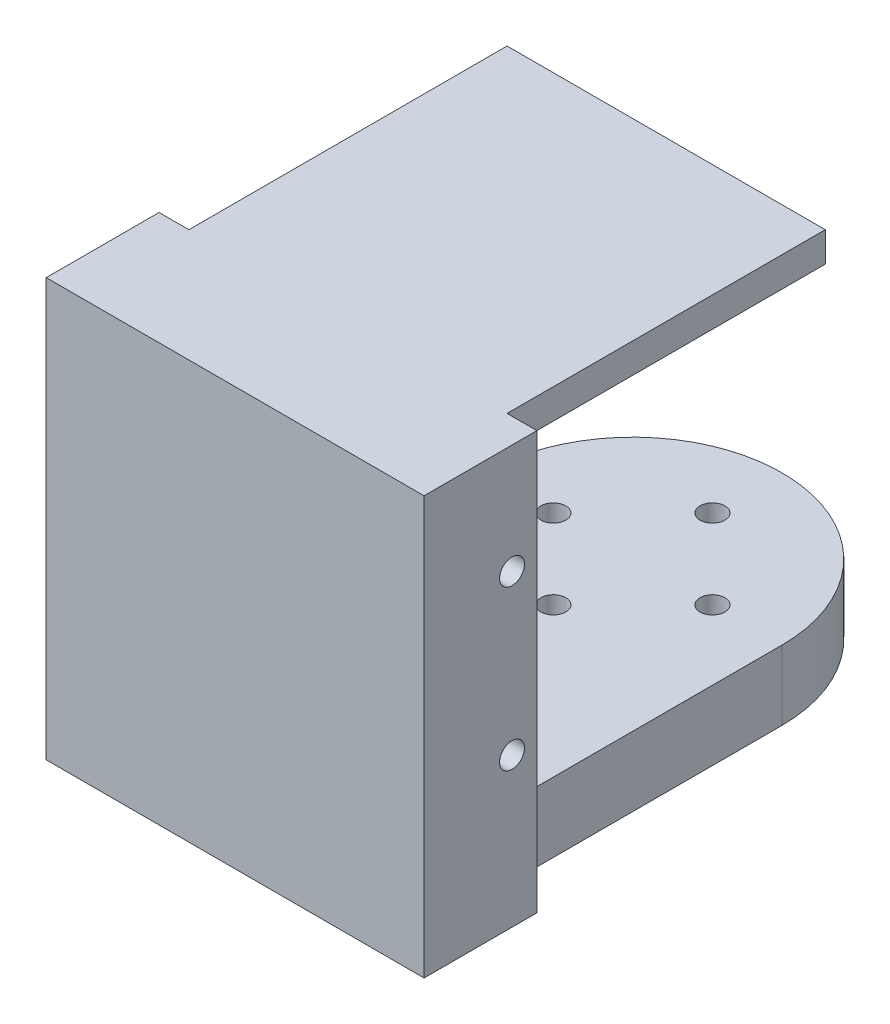
ISO-10303-21;
HEADER;
FILE_DESCRIPTION(('STEP AP214'),'2;1');
FILE_NAME('part.step','',(''),(''),'','','');
FILE_SCHEMA(('AUTOMOTIVE_DESIGN { 1 0 10303 214 1 1 1 1 }'));
ENDSEC;
DATA;
#1=APPLICATION_CONTEXT('core data for automotive mechanical design processes');
#2=APPLICATION_PROTOCOL_DEFINITION('international standard','automotive_design',2000,#1);
#3=PRODUCT_CONTEXT('',#1,'mechanical');
#4=PRODUCT('Part','Part','',(#3));
#5=PRODUCT_RELATED_PRODUCT_CATEGORY('part','',(#4));
#6=PRODUCT_DEFINITION_FORMATION('','',#4);
#7=PRODUCT_DEFINITION_CONTEXT('part definition',#1,'design');
#8=PRODUCT_DEFINITION('design','',#6,#7);
#9=PRODUCT_DEFINITION_SHAPE('','',#8);
#10=(LENGTH_UNIT() NAMED_UNIT(*) SI_UNIT(.MILLI.,.METRE.));
#11=(NAMED_UNIT(*) PLANE_ANGLE_UNIT() SI_UNIT($,.RADIAN.));
#12=(NAMED_UNIT(*) SI_UNIT($,.STERADIAN.) SOLID_ANGLE_UNIT());
#13=UNCERTAINTY_MEASURE_WITH_UNIT(LENGTH_MEASURE(1.E-05),#10,'distance_accuracy_value','');
#14=(GEOMETRIC_REPRESENTATION_CONTEXT(3) GLOBAL_UNCERTAINTY_ASSIGNED_CONTEXT((#13)) GLOBAL_UNIT_ASSIGNED_CONTEXT((#10,
#11,#12)) REPRESENTATION_CONTEXT('',''));
#15=CARTESIAN_POINT('',(0.,0.,0.));
#16=DIRECTION('',(0.,0.,1.));
#17=DIRECTION('',(1.,0.,0.));
#18=AXIS2_PLACEMENT_3D('',#15,#16,#17);
#19=CARTESIAN_POINT('',(11.,39.,-6.34691914212264));
#20=DIRECTION('',(1.,0.,0.));
#21=DIRECTION('',(0.,0.,-1.));
#22=AXIS2_PLACEMENT_3D('',#19,#20,#21);
#23=PLANE('',#22);
#24=DIRECTION('',(0.,1.,0.));
#25=VECTOR('',#24,1.);
#26=CARTESIAN_POINT('',(11.,7.,33.6530808578774));
#27=LINE('',#26,#25);
#28=CARTESIAN_POINT('',(11.,36.,33.6530808578774));
#29=VERTEX_POINT('',#28);
#30=CARTESIAN_POINT('',(11.,39.,33.6530808578774));
#31=VERTEX_POINT('',#30);
#32=EDGE_CURVE('E172',#29,#31,#27,.T.);
#33=ORIENTED_EDGE('',*,*,#32,.F.);
#34=DIRECTION('',(0.,0.,-1.));
#35=VECTOR('',#34,1.);
#36=CARTESIAN_POINT('',(11.,36.,13.6530808578774));
#37=LINE('',#36,#35);
#38=CARTESIAN_POINT('',(11.,36.,-3.34691914212264));
#39=VERTEX_POINT('',#38);
#40=EDGE_CURVE('E157',#39,#29,#37,.F.);
#41=ORIENTED_EDGE('',*,*,#40,.F.);
#42=DIRECTION('',(0.,1.,0.));
#43=VECTOR('',#42,1.);
#44=CARTESIAN_POINT('',(11.,40.5,-3.34691914212264));
#45=LINE('',#44,#43);
#46=CARTESIAN_POINT('',(11.,39.,-3.34691914212264));
#47=VERTEX_POINT('',#46);
#48=EDGE_CURVE('E192',#39,#47,#45,.T.);
#49=ORIENTED_EDGE('',*,*,#48,.T.);
#50=DIRECTION('',(0.,0.,1.));
#51=VECTOR('',#50,1.);
#52=CARTESIAN_POINT('',(11.,39.,33.6530808578774));
#53=LINE('',#52,#51);
#54=EDGE_CURVE('E181',#31,#47,#53,.F.);
#55=ORIENTED_EDGE('',*,*,#54,.F.);
#56=EDGE_LOOP('',(#33,#41,#49,#55));
#57=FACE_BOUND('',#56,.T.);
#58=ADVANCED_FACE('F17',(#57),#23,.T.);
#59=CARTESIAN_POINT('',(-11.,39.,33.6530808578774));
#60=DIRECTION('',(-1.,0.,0.));
#61=DIRECTION('',(0.,0.,1.));
#62=AXIS2_PLACEMENT_3D('',#59,#60,#61);
#63=PLANE('',#62);
#64=DIRECTION('',(0.,1.,0.));
#65=VECTOR('',#64,1.);
#66=CARTESIAN_POINT('',(-11.,7.,33.6530808578774));
#67=LINE('',#66,#65);
#68=CARTESIAN_POINT('',(-11.,39.,33.6530808578774));
#69=VERTEX_POINT('',#68);
#70=CARTESIAN_POINT('',(-11.,36.,33.6530808578774));
#71=VERTEX_POINT('',#70);
#72=EDGE_CURVE('E176',#69,#71,#67,.F.);
#73=ORIENTED_EDGE('',*,*,#72,.F.);
#74=DIRECTION('',(0.,0.,1.));
#75=VECTOR('',#74,1.);
#76=CARTESIAN_POINT('',(-11.,39.,33.6530808578774));
#77=LINE('',#76,#75);
#78=CARTESIAN_POINT('',(-11.,39.,-3.34691914212264));
#79=VERTEX_POINT('',#78);
#80=EDGE_CURVE('E215',#79,#69,#77,.T.);
#81=ORIENTED_EDGE('',*,*,#80,.F.);
#82=DIRECTION('',(0.,1.,0.));
#83=VECTOR('',#82,1.);
#84=CARTESIAN_POINT('',(-11.,40.5,-3.34691914212264));
#85=LINE('',#84,#83);
#86=CARTESIAN_POINT('',(-11.,36.,-3.34691914212264));
#87=VERTEX_POINT('',#86);
#88=EDGE_CURVE('E210',#79,#87,#85,.F.);
#89=ORIENTED_EDGE('',*,*,#88,.T.);
#90=DIRECTION('',(0.,0.,-1.));
#91=VECTOR('',#90,1.);
#92=CARTESIAN_POINT('',(-11.,36.,13.6530808578774));
#93=LINE('',#92,#91);
#94=EDGE_CURVE('E168',#71,#87,#93,.T.);
#95=ORIENTED_EDGE('',*,*,#94,.F.);
#96=EDGE_LOOP('',(#73,#81,#89,#95));
#97=FACE_BOUND('',#96,.T.);
#98=ADVANCED_FACE('F677',(#97),#63,.T.);
#99=CARTESIAN_POINT('',(0.,36.,13.6530808578774));
#100=DIRECTION('',(0.,-1.,0.));
#101=DIRECTION('',(0.,0.,-1.));
#102=AXIS2_PLACEMENT_3D('',#99,#100,#101);
#103=PLANE('',#102);
#104=DIRECTION('',(-1.,0.,0.));
#105=VECTOR('',#104,1.);
#106=CARTESIAN_POINT('',(15.,36.,33.6530808578774));
#107=LINE('',#106,#105);
#108=EDGE_CURVE('E160',#71,#29,#107,.F.);
#109=ORIENTED_EDGE('',*,*,#108,.F.);
#110=ORIENTED_EDGE('',*,*,#94,.T.);
#111=DIRECTION('',(1.,0.,0.));
#112=VECTOR('',#111,1.);
#113=CARTESIAN_POINT('',(0.,36.,-3.34691914212264));
#114=LINE('',#113,#112);
#115=EDGE_CURVE('E162',#87,#39,#114,.T.);
#116=ORIENTED_EDGE('',*,*,#115,.T.);
#117=ORIENTED_EDGE('',*,*,#40,.T.);
#118=EDGE_LOOP('',(#109,#110,#116,#117));
#119=FACE_BOUND('',#118,.T.);
#120=ADVANCED_FACE('F159',(#119),#103,.T.);
#121=CARTESIAN_POINT('',(16.,39.,33.6530808578774));
#122=DIRECTION('',(0.,-1.,0.));
#123=DIRECTION('',(1.,0.,0.));
#124=AXIS2_PLACEMENT_3D('',#121,#122,#123);
#125=PLANE('',#124);
#126=DIRECTION('',(0.,0.,-1.));
#127=VECTOR('',#126,1.);
#128=CARTESIAN_POINT('',(-16.,39.,33.6530808578774));
#129=LINE('',#128,#127);
#130=CARTESIAN_POINT('',(-16.,39.,28.6530808578774));
#131=VERTEX_POINT('',#130);
#132=CARTESIAN_POINT('',(-16.,39.,33.6530808578774));
#133=VERTEX_POINT('',#132);
#134=EDGE_CURVE('E302',#131,#133,#129,.F.);
#135=ORIENTED_EDGE('',*,*,#134,.F.);
#136=DIRECTION('',(0.,0.,1.));
#137=VECTOR('',#136,1.);
#138=CARTESIAN_POINT('',(-16.,39.,33.6530808578774));
#139=LINE('',#138,#137);
#140=CARTESIAN_POINT('',(-16.,39.,-3.34691914212264));
#141=VERTEX_POINT('',#140);
#142=EDGE_CURVE('E309',#141,#131,#139,.T.);
#143=ORIENTED_EDGE('',*,*,#142,.F.);
#144=DIRECTION('',(1.,0.,0.));
#145=VECTOR('',#144,1.);
#146=CARTESIAN_POINT('',(0.,39.,-3.34691914212264));
#147=LINE('',#146,#145);
#148=EDGE_CURVE('E221',#141,#79,#147,.T.);
#149=ORIENTED_EDGE('',*,*,#148,.T.);
#150=ORIENTED_EDGE('',*,*,#80,.T.);
#151=DIRECTION('',(-1.,0.,0.));
#152=VECTOR('',#151,1.);
#153=CARTESIAN_POINT('',(15.,39.,33.6530808578774));
#154=LINE('',#153,#152);
#155=EDGE_CURVE('E190',#133,#69,#154,.F.);
#156=ORIENTED_EDGE('',*,*,#155,.F.);
#157=EDGE_LOOP('',(#135,#143,#149,#150,#156));
#158=FACE_BOUND('',#157,.T.);
#159=ADVANCED_FACE('F474',(#158),#125,.T.);
#160=CARTESIAN_POINT('',(16.,39.,33.6530808578774));
#161=DIRECTION('',(0.,-1.,0.));
#162=DIRECTION('',(1.,0.,0.));
#163=AXIS2_PLACEMENT_3D('',#160,#161,#162);
#164=PLANE('',#163);
#165=DIRECTION('',(-1.,0.,0.));
#166=VECTOR('',#165,1.);
#167=CARTESIAN_POINT('',(15.,39.,33.6530808578774));
#168=LINE('',#167,#166);
#169=CARTESIAN_POINT('',(16.,39.,33.6530808578774));
#170=VERTEX_POINT('',#169);
#171=EDGE_CURVE('E184',#31,#170,#168,.F.);
#172=ORIENTED_EDGE('',*,*,#171,.F.);
#173=ORIENTED_EDGE('',*,*,#54,.T.);
#174=DIRECTION('',(1.,0.,0.));
#175=VECTOR('',#174,1.);
#176=CARTESIAN_POINT('',(0.,39.,-3.34691914212264));
#177=LINE('',#176,#175);
#178=CARTESIAN_POINT('',(16.,39.,-3.34691914212264));
#179=VERTEX_POINT('',#178);
#180=EDGE_CURVE('E185',#47,#179,#177,.T.);
#181=ORIENTED_EDGE('',*,*,#180,.T.);
#182=DIRECTION('',(0.,0.,-1.));
#183=VECTOR('',#182,1.);
#184=CARTESIAN_POINT('',(16.,39.,33.6530808578774));
#185=LINE('',#184,#183);
#186=CARTESIAN_POINT('',(16.,39.,28.6530808578774));
#187=VERTEX_POINT('',#186);
#188=EDGE_CURVE('E331',#187,#179,#185,.T.);
#189=ORIENTED_EDGE('',*,*,#188,.F.);
#190=DIRECTION('',(0.,0.,1.));
#191=VECTOR('',#190,1.);
#192=CARTESIAN_POINT('',(16.,39.,29.6530808578774));
#193=LINE('',#192,#191);
#194=EDGE_CURVE('E291',#170,#187,#193,.F.);
#195=ORIENTED_EDGE('',*,*,#194,.F.);
#196=EDGE_LOOP('',(#172,#173,#181,#189,#195));
#197=FACE_BOUND('',#196,.T.);
#198=ADVANCED_FACE('F368',(#197),#164,.T.);
#199=CARTESIAN_POINT('',(0.,40.5,-3.34691914212264));
#200=DIRECTION('',(0.,0.,1.));
#201=DIRECTION('',(1.,0.,0.));
#202=AXIS2_PLACEMENT_3D('',#199,#200,#201);
#203=PLANE('',#202);
#204=DIRECTION('',(0.,1.,0.));
#205=VECTOR('',#204,1.);
#206=CARTESIAN_POINT('',(16.,42.,-3.34691914212264));
#207=LINE('',#206,#205);
#208=CARTESIAN_POINT('',(16.,42.,-3.34691914212264));
#209=VERTEX_POINT('',#208);
#210=EDGE_CURVE('E283',#179,#209,#207,.T.);
#211=ORIENTED_EDGE('',*,*,#210,.F.);
#212=ORIENTED_EDGE('',*,*,#180,.F.);
#213=ORIENTED_EDGE('',*,*,#48,.F.);
#214=ORIENTED_EDGE('',*,*,#115,.F.);
#215=ORIENTED_EDGE('',*,*,#88,.F.);
#216=ORIENTED_EDGE('',*,*,#148,.F.);
#217=DIRECTION('',(0.,1.,0.));
#218=VECTOR('',#217,1.);
#219=CARTESIAN_POINT('',(-16.,39.,-3.34691914212264));
#220=LINE('',#219,#218);
#221=CARTESIAN_POINT('',(-16.,42.,-3.34691914212264));
#222=VERTEX_POINT('',#221);
#223=EDGE_CURVE('E179',#222,#141,#220,.F.);
#224=ORIENTED_EDGE('',*,*,#223,.F.);
#225=DIRECTION('',(1.,0.,0.));
#226=VECTOR('',#225,1.);
#227=CARTESIAN_POINT('',(0.,42.,-3.34691914212264));
#228=LINE('',#227,#226);
#229=EDGE_CURVE('E334',#209,#222,#228,.F.);
#230=ORIENTED_EDGE('',*,*,#229,.F.);
#231=EDGE_LOOP('',(#211,#212,#213,#214,#215,#216,#224,#230));
#232=FACE_BOUND('',#231,.T.);
#233=ADVANCED_FACE('F374',(#232),#203,.F.);
#234=CARTESIAN_POINT('',(15.,7.,33.6530808578774));
#235=DIRECTION('',(0.,0.,-1.));
#236=DIRECTION('',(-1.,0.,0.));
#237=AXIS2_PLACEMENT_3D('',#234,#235,#236);
#238=PLANE('',#237);
#239=ORIENTED_EDGE('',*,*,#72,.T.);
#240=ORIENTED_EDGE('',*,*,#108,.T.);
#241=ORIENTED_EDGE('',*,*,#32,.T.);
#242=ORIENTED_EDGE('',*,*,#171,.T.);
#243=DIRECTION('',(0.,1.,0.));
#244=VECTOR('',#243,1.);
#245=CARTESIAN_POINT('',(16.,7.,33.6530808578774));
#246=LINE('',#245,#244);
#247=CARTESIAN_POINT('',(16.,7.,33.6530808578774));
#248=VERTEX_POINT('',#247);
#249=EDGE_CURVE('E287',#248,#170,#246,.T.);
#250=ORIENTED_EDGE('',*,*,#249,.F.);
#251=DIRECTION('',(1.,0.,0.));
#252=VECTOR('',#251,1.);
#253=CARTESIAN_POINT('',(0.,7.,33.6530808578774));
#254=LINE('',#253,#252);
#255=CARTESIAN_POINT('',(-16.,7.,33.6530808578774));
#256=VERTEX_POINT('',#255);
#257=EDGE_CURVE('E317',#256,#248,#254,.T.);
#258=ORIENTED_EDGE('',*,*,#257,.F.);
#259=DIRECTION('',(0.,1.,0.));
#260=VECTOR('',#259,1.);
#261=CARTESIAN_POINT('',(-16.,7.,33.6530808578774));
#262=LINE('',#261,#260);
#263=EDGE_CURVE('E298',#133,#256,#262,.F.);
#264=ORIENTED_EDGE('',*,*,#263,.F.);
#265=ORIENTED_EDGE('',*,*,#155,.T.);
#266=EDGE_LOOP('',(#239,#240,#241,#242,#250,#258,#264,#265));
#267=FACE_BOUND('',#266,.T.);
#268=ADVANCED_FACE('F171',(#267),#238,.T.);
#269=CARTESIAN_POINT('',(-16.,39.,33.6530808578774));
#270=DIRECTION('',(-1.,0.,0.));
#271=DIRECTION('',(0.,0.,1.));
#272=AXIS2_PLACEMENT_3D('',#269,#270,#271);
#273=PLANE('',#272);
#274=DIRECTION('',(0.,1.,0.));
#275=VECTOR('',#274,1.);
#276=CARTESIAN_POINT('',(-16.,3.5,28.6530808578774));
#277=LINE('',#276,#275);
#278=CARTESIAN_POINT('',(-16.,42.,28.6530808578774));
#279=VERTEX_POINT('',#278);
#280=EDGE_CURVE('E434',#279,#131,#277,.F.);
#281=ORIENTED_EDGE('',*,*,#280,.F.);
#282=DIRECTION('',(0.,0.,1.));
#283=VECTOR('',#282,1.);
#284=CARTESIAN_POINT('',(-16.,42.,36.8265404289387));
#285=LINE('',#284,#283);
#286=EDGE_CURVE('E337',#222,#279,#285,.T.);
#287=ORIENTED_EDGE('',*,*,#286,.F.);
#288=ORIENTED_EDGE('',*,*,#223,.T.);
#289=ORIENTED_EDGE('',*,*,#142,.T.);
#290=EDGE_LOOP('',(#281,#287,#288,#289));
#291=FACE_BOUND('',#290,.T.);
#292=ADVANCED_FACE('F464',(#291),#273,.T.);
#293=CARTESIAN_POINT('',(-16.,7.,33.6530808578774));
#294=DIRECTION('',(1.,0.,0.));
#295=DIRECTION('',(0.,0.,-1.));
#296=AXIS2_PLACEMENT_3D('',#293,#294,#295);
#297=PLANE('',#296);
#298=CARTESIAN_POINT('',(-16.,31.0000001043081,31.1530808578774));
#299=DIRECTION('',(-1.,0.,0.));
#300=DIRECTION('',(0.,0.,1.));
#301=AXIS2_PLACEMENT_3D('',#298,#299,#300);
#302=CIRCLE('',#301,1.25);
#303=CARTESIAN_POINT('',(-16.,31.0000001043081,32.4030808578774));
#304=VERTEX_POINT('',#303);
#305=EDGE_CURVE('E20',#304,#304,#302,.T.);
#306=ORIENTED_EDGE('',*,*,#305,.T.);
#307=EDGE_LOOP('',(#306));
#308=FACE_BOUND('',#307,.T.);
#309=CARTESIAN_POINT('',(-16.,15.0000001043081,31.1530808578774));
#310=DIRECTION('',(-1.,0.,0.));
#311=DIRECTION('',(0.,0.,1.));
#312=AXIS2_PLACEMENT_3D('',#309,#310,#311);
#313=CIRCLE('',#312,1.25);
#314=CARTESIAN_POINT('',(-16.,15.0000001043081,32.4030808578774));
#315=VERTEX_POINT('',#314);
#316=EDGE_CURVE('E288',#315,#315,#313,.T.);
#317=ORIENTED_EDGE('',*,*,#316,.T.);
#318=EDGE_LOOP('',(#317));
#319=FACE_BOUND('',#318,.T.);
#320=DIRECTION('',(0.,0.,1.));
#321=VECTOR('',#320,1.);
#322=CARTESIAN_POINT('',(-16.,7.,12.5));
#323=LINE('',#322,#321);
#324=CARTESIAN_POINT('',(-16.,7.,28.6530808578774));
#325=VERTEX_POINT('',#324);
#326=EDGE_CURVE('E321',#325,#256,#323,.T.);
#327=ORIENTED_EDGE('',*,*,#326,.F.);
#328=DIRECTION('',(0.,1.,0.));
#329=VECTOR('',#328,1.);
#330=CARTESIAN_POINT('',(-16.,3.5,28.6530808578774));
#331=LINE('',#330,#329);
#332=EDGE_CURVE('E440',#131,#325,#331,.F.);
#333=ORIENTED_EDGE('',*,*,#332,.F.);
#334=ORIENTED_EDGE('',*,*,#134,.T.);
#335=ORIENTED_EDGE('',*,*,#263,.T.);
#336=EDGE_LOOP('',(#327,#333,#334,#335));
#337=FACE_BOUND('',#336,.T.);
#338=ADVANCED_FACE('F475',(#308,#319,#337),#297,.T.);
#339=CARTESIAN_POINT('',(16.,31.0000001043081,31.1530808578774));
#340=DIRECTION('',(-1.,0.,0.));
#341=DIRECTION('',(0.,0.,1.));
#342=AXIS2_PLACEMENT_3D('',#339,#340,#341);
#343=CYLINDRICAL_SURFACE('',#342,1.25);
#344=CARTESIAN_POINT('',(-19.,31.0000001043081,31.1530808578774));
#345=DIRECTION('',(-1.,0.,0.));
#346=DIRECTION('',(0.,0.,1.));
#347=AXIS2_PLACEMENT_3D('',#344,#345,#346);
#348=CIRCLE('',#347,1.25);
#349=CARTESIAN_POINT('',(-19.,31.0000001043081,32.4030808578774));
#350=VERTEX_POINT('',#349);
#351=EDGE_CURVE('E274',#350,#350,#348,.F.);
#352=ORIENTED_EDGE('',*,*,#351,.F.);
#353=EDGE_LOOP('',(#352));
#354=FACE_BOUND('',#353,.T.);
#355=ORIENTED_EDGE('',*,*,#305,.F.);
#356=EDGE_LOOP('',(#355));
#357=FACE_BOUND('',#356,.T.);
#358=ADVANCED_FACE('F655',(#354,#357),#343,.F.);
#359=CARTESIAN_POINT('',(16.,15.0000001043081,31.1530808578774));
#360=DIRECTION('',(-1.,0.,0.));
#361=DIRECTION('',(0.,0.,1.));
#362=AXIS2_PLACEMENT_3D('',#359,#360,#361);
#363=CYLINDRICAL_SURFACE('',#362,1.25);
#364=CARTESIAN_POINT('',(-19.,15.0000001043081,31.1530808578774));
#365=DIRECTION('',(-1.,0.,0.));
#366=DIRECTION('',(0.,0.,1.));
#367=AXIS2_PLACEMENT_3D('',#364,#365,#366);
#368=CIRCLE('',#367,1.25);
#369=CARTESIAN_POINT('',(-19.,15.0000001043081,32.4030808578774));
#370=VERTEX_POINT('',#369);
#371=EDGE_CURVE('E269',#370,#370,#368,.F.);
#372=ORIENTED_EDGE('',*,*,#371,.F.);
#373=EDGE_LOOP('',(#372));
#374=FACE_BOUND('',#373,.T.);
#375=ORIENTED_EDGE('',*,*,#316,.F.);
#376=EDGE_LOOP('',(#375));
#377=FACE_BOUND('',#376,.T.);
#378=ADVANCED_FACE('F645',(#374,#377),#363,.F.);
#379=CARTESIAN_POINT('',(16.,31.0000001043081,31.1530808578774));
#380=DIRECTION('',(1.,0.,0.));
#381=DIRECTION('',(0.,0.,-1.));
#382=AXIS2_PLACEMENT_3D('',#379,#380,#381);
#383=CYLINDRICAL_SURFACE('',#382,1.25);
#384=CARTESIAN_POINT('',(16.,31.0000001043081,31.1530808578774));
#385=DIRECTION('',(1.,0.,0.));
#386=DIRECTION('',(0.,0.,-1.));
#387=AXIS2_PLACEMENT_3D('',#384,#385,#386);
#388=CIRCLE('',#387,1.25);
#389=CARTESIAN_POINT('',(16.,31.0000001043081,29.9030808578774));
#390=VERTEX_POINT('',#389);
#391=EDGE_CURVE('E284',#390,#390,#388,.T.);
#392=ORIENTED_EDGE('',*,*,#391,.F.);
#393=EDGE_LOOP('',(#392));
#394=FACE_BOUND('',#393,.T.);
#395=CARTESIAN_POINT('',(19.,31.0000001043081,31.1530808578774));
#396=DIRECTION('',(1.,0.,0.));
#397=DIRECTION('',(0.,0.,-1.));
#398=AXIS2_PLACEMENT_3D('',#395,#396,#397);
#399=CIRCLE('',#398,1.25);
#400=CARTESIAN_POINT('',(19.,31.0000001043081,29.9030808578774));
#401=VERTEX_POINT('',#400);
#402=EDGE_CURVE('E264',#401,#401,#399,.F.);
#403=ORIENTED_EDGE('',*,*,#402,.F.);
#404=EDGE_LOOP('',(#403));
#405=FACE_BOUND('',#404,.T.);
#406=ADVANCED_FACE('F642',(#394,#405),#383,.F.);
#407=CARTESIAN_POINT('',(16.,15.0000001043081,31.1530808578774));
#408=DIRECTION('',(1.,0.,0.));
#409=DIRECTION('',(0.,0.,-1.));
#410=AXIS2_PLACEMENT_3D('',#407,#408,#409);
#411=CYLINDRICAL_SURFACE('',#410,1.25);
#412=CARTESIAN_POINT('',(16.,15.0000001043081,31.1530808578774));
#413=DIRECTION('',(1.,0.,0.));
#414=DIRECTION('',(0.,0.,-1.));
#415=AXIS2_PLACEMENT_3D('',#412,#413,#414);
#416=CIRCLE('',#415,1.25);
#417=CARTESIAN_POINT('',(16.,15.0000001043081,29.9030808578774));
#418=VERTEX_POINT('',#417);
#419=EDGE_CURVE('E279',#418,#418,#416,.T.);
#420=ORIENTED_EDGE('',*,*,#419,.F.);
#421=EDGE_LOOP('',(#420));
#422=FACE_BOUND('',#421,.T.);
#423=CARTESIAN_POINT('',(19.,15.0000001043081,31.1530808578774));
#424=DIRECTION('',(1.,0.,0.));
#425=DIRECTION('',(0.,0.,-1.));
#426=AXIS2_PLACEMENT_3D('',#423,#424,#425);
#427=CIRCLE('',#426,1.25);
#428=CARTESIAN_POINT('',(19.,15.0000001043081,29.9030808578774));
#429=VERTEX_POINT('',#428);
#430=EDGE_CURVE('E260',#429,#429,#427,.F.);
#431=ORIENTED_EDGE('',*,*,#430,.F.);
#432=EDGE_LOOP('',(#431));
#433=FACE_BOUND('',#432,.T.);
#434=ADVANCED_FACE('F644',(#422,#433),#411,.F.);
#435=CARTESIAN_POINT('',(16.,7.,29.6530808578774));
#436=DIRECTION('',(-1.,0.,0.));
#437=DIRECTION('',(0.,0.,1.));
#438=AXIS2_PLACEMENT_3D('',#435,#436,#437);
#439=PLANE('',#438);
#440=ORIENTED_EDGE('',*,*,#419,.T.);
#441=EDGE_LOOP('',(#440));
#442=FACE_BOUND('',#441,.T.);
#443=ORIENTED_EDGE('',*,*,#391,.T.);
#444=EDGE_LOOP('',(#443));
#445=FACE_BOUND('',#444,.T.);
#446=DIRECTION('',(0.,0.,1.));
#447=VECTOR('',#446,1.);
#448=CARTESIAN_POINT('',(16.,7.,12.5));
#449=LINE('',#448,#447);
#450=CARTESIAN_POINT('',(16.,7.,28.6530808578774));
#451=VERTEX_POINT('',#450);
#452=EDGE_CURVE('E389',#248,#451,#449,.F.);
#453=ORIENTED_EDGE('',*,*,#452,.F.);
#454=ORIENTED_EDGE('',*,*,#249,.T.);
#455=ORIENTED_EDGE('',*,*,#194,.T.);
#456=DIRECTION('',(0.,1.,0.));
#457=VECTOR('',#456,1.);
#458=CARTESIAN_POINT('',(16.,3.5,28.6530808578774));
#459=LINE('',#458,#457);
#460=EDGE_CURVE('E403',#451,#187,#459,.T.);
#461=ORIENTED_EDGE('',*,*,#460,.F.);
#462=EDGE_LOOP('',(#453,#454,#455,#461));
#463=FACE_BOUND('',#462,.T.);
#464=ADVANCED_FACE('F652',(#442,#445,#463),#439,.T.);
#465=CARTESIAN_POINT('',(16.,42.,33.6530808578774));
#466=DIRECTION('',(1.,0.,0.));
#467=DIRECTION('',(0.,0.,-1.));
#468=AXIS2_PLACEMENT_3D('',#465,#466,#467);
#469=PLANE('',#468);
#470=DIRECTION('',(0.,1.,0.));
#471=VECTOR('',#470,1.);
#472=CARTESIAN_POINT('',(16.,3.5,28.6530808578774));
#473=LINE('',#472,#471);
#474=CARTESIAN_POINT('',(16.,42.,28.6530808578774));
#475=VERTEX_POINT('',#474);
#476=EDGE_CURVE('E400',#187,#475,#473,.T.);
#477=ORIENTED_EDGE('',*,*,#476,.F.);
#478=ORIENTED_EDGE('',*,*,#188,.T.);
#479=ORIENTED_EDGE('',*,*,#210,.T.);
#480=DIRECTION('',(0.,0.,1.));
#481=VECTOR('',#480,1.);
#482=CARTESIAN_POINT('',(16.,42.,36.8265404289387));
#483=LINE('',#482,#481);
#484=EDGE_CURVE('E382',#475,#209,#483,.F.);
#485=ORIENTED_EDGE('',*,*,#484,.F.);
#486=EDGE_LOOP('',(#477,#478,#479,#485));
#487=FACE_BOUND('',#486,.T.);
#488=ADVANCED_FACE('F381',(#487),#469,.T.);
#489=CARTESIAN_POINT('',(0.,42.,36.8265404289387));
#490=DIRECTION('',(0.,1.,0.));
#491=DIRECTION('',(0.,0.,1.));
#492=AXIS2_PLACEMENT_3D('',#489,#490,#491);
#493=PLANE('',#492);
#494=DIRECTION('',(-1.,0.,0.));
#495=VECTOR('',#494,1.);
#496=CARTESIAN_POINT('',(17.,42.,28.6530808578774));
#497=LINE('',#496,#495);
#498=CARTESIAN_POINT('',(19.,42.,28.6530808578774));
#499=VERTEX_POINT('',#498);
#500=EDGE_CURVE('E387',#475,#499,#497,.F.);
#501=ORIENTED_EDGE('',*,*,#500,.F.);
#502=ORIENTED_EDGE('',*,*,#484,.T.);
#503=ORIENTED_EDGE('',*,*,#229,.T.);
#504=ORIENTED_EDGE('',*,*,#286,.T.);
#505=DIRECTION('',(-1.,0.,0.));
#506=VECTOR('',#505,1.);
#507=CARTESIAN_POINT('',(-17.,42.,28.6530808578774));
#508=LINE('',#507,#506);
#509=CARTESIAN_POINT('',(-19.,42.,28.6530808578774));
#510=VERTEX_POINT('',#509);
#511=EDGE_CURVE('E430',#510,#279,#508,.F.);
#512=ORIENTED_EDGE('',*,*,#511,.F.);
#513=DIRECTION('',(0.,0.,1.));
#514=VECTOR('',#513,1.);
#515=CARTESIAN_POINT('',(-19.,42.,36.8265404289387));
#516=LINE('',#515,#514);
#517=CARTESIAN_POINT('',(-19.,42.,40.));
#518=VERTEX_POINT('',#517);
#519=EDGE_CURVE('E424',#518,#510,#516,.F.);
#520=ORIENTED_EDGE('',*,*,#519,.F.);
#521=DIRECTION('',(1.,0.,0.));
#522=VECTOR('',#521,1.);
#523=CARTESIAN_POINT('',(-15.,42.,40.));
#524=LINE('',#523,#522);
#525=CARTESIAN_POINT('',(19.,42.,40.));
#526=VERTEX_POINT('',#525);
#527=EDGE_CURVE('E273',#526,#518,#524,.F.);
#528=ORIENTED_EDGE('',*,*,#527,.F.);
#529=DIRECTION('',(0.,0.,-1.));
#530=VECTOR('',#529,1.);
#531=CARTESIAN_POINT('',(19.,42.,36.8265404289387));
#532=LINE('',#531,#530);
#533=EDGE_CURVE('E535',#499,#526,#532,.F.);
#534=ORIENTED_EDGE('',*,*,#533,.F.);
#535=EDGE_LOOP('',(#501,#502,#503,#504,#512,#520,#528,#534));
#536=FACE_BOUND('',#535,.T.);
#537=ADVANCED_FACE('F385',(#536),#493,.T.);
#538=CARTESIAN_POINT('',(0.,7.,12.5));
#539=DIRECTION('',(0.,1.,0.));
#540=DIRECTION('',(0.,0.,1.));
#541=AXIS2_PLACEMENT_3D('',#538,#539,#540);
#542=PLANE('',#541);
#543=CARTESIAN_POINT('',(8.,7.,0.));
#544=DIRECTION('',(0.,1.,0.));
#545=DIRECTION('',(0.,0.,1.));
#546=AXIS2_PLACEMENT_3D('',#543,#544,#545);
#547=CIRCLE('',#546,1.25);
#548=CARTESIAN_POINT('',(8.,7.,1.25));
#549=VERTEX_POINT('',#548);
#550=EDGE_CURVE('E252',#549,#549,#547,.F.);
#551=ORIENTED_EDGE('',*,*,#550,.T.);
#552=EDGE_LOOP('',(#551));
#553=FACE_BOUND('',#552,.T.);
#554=CARTESIAN_POINT('',(-8.,7.,0.));
#555=DIRECTION('',(0.,1.,0.));
#556=DIRECTION('',(0.,0.,1.));
#557=AXIS2_PLACEMENT_3D('',#554,#555,#556);
#558=CIRCLE('',#557,1.25);
#559=CARTESIAN_POINT('',(-8.,7.,1.25));
#560=VERTEX_POINT('',#559);
#561=EDGE_CURVE('E248',#560,#560,#558,.F.);
#562=ORIENTED_EDGE('',*,*,#561,.T.);
#563=EDGE_LOOP('',(#562));
#564=FACE_BOUND('',#563,.T.);
#565=CARTESIAN_POINT('',(0.,7.,-8.));
#566=DIRECTION('',(0.,1.,0.));
#567=DIRECTION('',(0.,0.,1.));
#568=AXIS2_PLACEMENT_3D('',#565,#566,#567);
#569=CIRCLE('',#568,1.25);
#570=CARTESIAN_POINT('',(0.,7.,-6.75));
#571=VERTEX_POINT('',#570);
#572=EDGE_CURVE('E244',#571,#571,#569,.F.);
#573=ORIENTED_EDGE('',*,*,#572,.T.);
#574=EDGE_LOOP('',(#573));
#575=FACE_BOUND('',#574,.T.);
#576=CARTESIAN_POINT('',(0.,7.,8.));
#577=DIRECTION('',(0.,1.,0.));
#578=DIRECTION('',(0.,0.,1.));
#579=AXIS2_PLACEMENT_3D('',#576,#577,#578);
#580=CIRCLE('',#579,1.25);
#581=CARTESIAN_POINT('',(0.,7.,9.25));
#582=VERTEX_POINT('',#581);
#583=EDGE_CURVE('E239',#582,#582,#580,.F.);
#584=ORIENTED_EDGE('',*,*,#583,.T.);
#585=EDGE_LOOP('',(#584));
#586=FACE_BOUND('',#585,.T.);
#587=ORIENTED_EDGE('',*,*,#326,.T.);
#588=ORIENTED_EDGE('',*,*,#257,.T.);
#589=ORIENTED_EDGE('',*,*,#452,.T.);
#590=DIRECTION('',(-1.,0.,0.));
#591=VECTOR('',#590,1.);
#592=CARTESIAN_POINT('',(17.,7.,28.6530808578774));
#593=LINE('',#592,#591);
#594=CARTESIAN_POINT('',(15.,7.,28.6530808578774));
#595=VERTEX_POINT('',#594);
#596=EDGE_CURVE('E64',#595,#451,#593,.F.);
#597=ORIENTED_EDGE('',*,*,#596,.F.);
#598=DIRECTION('',(0.,0.,-1.));
#599=VECTOR('',#598,1.);
#600=CARTESIAN_POINT('',(15.,7.,40.));
#601=LINE('',#600,#599);
#602=CARTESIAN_POINT('',(15.,7.,0.));
#603=VERTEX_POINT('',#602);
#604=EDGE_CURVE('E508',#603,#595,#601,.F.);
#605=ORIENTED_EDGE('',*,*,#604,.F.);
#606=CARTESIAN_POINT('',(0.,7.,0.));
#607=DIRECTION('',(0.,1.,0.));
#608=DIRECTION('',(0.,0.,1.));
#609=AXIS2_PLACEMENT_3D('',#606,#607,#608);
#610=CIRCLE('',#609,15.);
#611=CARTESIAN_POINT('',(-15.,7.,0.));
#612=VERTEX_POINT('',#611);
#613=EDGE_CURVE('E256',#612,#603,#610,.F.);
#614=ORIENTED_EDGE('',*,*,#613,.F.);
#615=DIRECTION('',(0.,0.,1.));
#616=VECTOR('',#615,1.);
#617=CARTESIAN_POINT('',(-15.,7.,0.));
#618=LINE('',#617,#616);
#619=CARTESIAN_POINT('',(-15.,7.,28.6530808578774));
#620=VERTEX_POINT('',#619);
#621=EDGE_CURVE('E55',#620,#612,#618,.F.);
#622=ORIENTED_EDGE('',*,*,#621,.F.);
#623=DIRECTION('',(-1.,0.,0.));
#624=VECTOR('',#623,1.);
#625=CARTESIAN_POINT('',(-17.,7.,28.6530808578774));
#626=LINE('',#625,#624);
#627=EDGE_CURVE('E437',#325,#620,#626,.F.);
#628=ORIENTED_EDGE('',*,*,#627,.F.);
#629=EDGE_LOOP('',(#587,#588,#589,#597,#605,#614,#622,#628));
#630=FACE_BOUND('',#629,.T.);
#631=ADVANCED_FACE('F478',(#553,#564,#575,#586,#630),#542,.T.);
#632=CARTESIAN_POINT('',(-15.,0.,0.));
#633=DIRECTION('',(-1.,0.,0.));
#634=DIRECTION('',(0.,0.,1.));
#635=AXIS2_PLACEMENT_3D('',#632,#633,#634);
#636=PLANE('',#635);
#637=DIRECTION('',(0.,1.,0.));
#638=VECTOR('',#637,1.);
#639=CARTESIAN_POINT('',(-15.,0.,0.));
#640=LINE('',#639,#638);
#641=CARTESIAN_POINT('',(-15.,0.,0.));
#642=VERTEX_POINT('',#641);
#643=EDGE_CURVE('E259',#642,#612,#640,.T.);
#644=ORIENTED_EDGE('',*,*,#643,.F.);
#645=DIRECTION('',(0.,0.,1.));
#646=VECTOR('',#645,1.);
#647=CARTESIAN_POINT('',(-15.,0.,12.5));
#648=LINE('',#647,#646);
#649=CARTESIAN_POINT('',(-15.,0.,28.6530808578774));
#650=VERTEX_POINT('',#649);
#651=EDGE_CURVE('E243',#642,#650,#648,.T.);
#652=ORIENTED_EDGE('',*,*,#651,.T.);
#653=DIRECTION('',(0.,1.,0.));
#654=VECTOR('',#653,1.);
#655=CARTESIAN_POINT('',(-15.,3.5,28.6530808578774));
#656=LINE('',#655,#654);
#657=EDGE_CURVE('E427',#620,#650,#656,.F.);
#658=ORIENTED_EDGE('',*,*,#657,.F.);
#659=ORIENTED_EDGE('',*,*,#621,.T.);
#660=EDGE_LOOP('',(#644,#652,#658,#659));
#661=FACE_BOUND('',#660,.T.);
#662=ADVANCED_FACE('F495',(#661),#636,.T.);
#663=CARTESIAN_POINT('',(-17.,3.5,28.6530808578774));
#664=DIRECTION('',(0.,0.,-1.));
#665=DIRECTION('',(-1.,0.,0.));
#666=AXIS2_PLACEMENT_3D('',#663,#664,#665);
#667=PLANE('',#666);
#668=ORIENTED_EDGE('',*,*,#627,.T.);
#669=ORIENTED_EDGE('',*,*,#657,.T.);
#670=DIRECTION('',(1.,0.,0.));
#671=VECTOR('',#670,1.);
#672=CARTESIAN_POINT('',(0.,0.,28.6530808578774));
#673=LINE('',#672,#671);
#674=CARTESIAN_POINT('',(-19.,0.,28.6530808578774));
#675=VERTEX_POINT('',#674);
#676=EDGE_CURVE('E482',#650,#675,#673,.F.);
#677=ORIENTED_EDGE('',*,*,#676,.T.);
#678=DIRECTION('',(0.,1.,0.));
#679=VECTOR('',#678,1.);
#680=CARTESIAN_POINT('',(-19.,21.,28.6530808578774));
#681=LINE('',#680,#679);
#682=EDGE_CURVE('E278',#510,#675,#681,.F.);
#683=ORIENTED_EDGE('',*,*,#682,.F.);
#684=ORIENTED_EDGE('',*,*,#511,.T.);
#685=ORIENTED_EDGE('',*,*,#280,.T.);
#686=ORIENTED_EDGE('',*,*,#332,.T.);
#687=EDGE_LOOP('',(#668,#669,#677,#683,#684,#685,#686));
#688=FACE_BOUND('',#687,.T.);
#689=ADVANCED_FACE('F469',(#688),#667,.T.);
#690=CARTESIAN_POINT('',(-19.,21.,36.8265404289387));
#691=DIRECTION('',(-1.,0.,0.));
#692=DIRECTION('',(0.,0.,1.));
#693=AXIS2_PLACEMENT_3D('',#690,#691,#692);
#694=PLANE('',#693);
#695=ORIENTED_EDGE('',*,*,#371,.T.);
#696=EDGE_LOOP('',(#695));
#697=FACE_BOUND('',#696,.T.);
#698=ORIENTED_EDGE('',*,*,#351,.T.);
#699=EDGE_LOOP('',(#698));
#700=FACE_BOUND('',#699,.T.);
#701=ORIENTED_EDGE('',*,*,#519,.T.);
#702=ORIENTED_EDGE('',*,*,#682,.T.);
#703=DIRECTION('',(0.,0.,1.));
#704=VECTOR('',#703,1.);
#705=CARTESIAN_POINT('',(-19.,0.,12.5));
#706=LINE('',#705,#704);
#707=CARTESIAN_POINT('',(-19.,0.,40.));
#708=VERTEX_POINT('',#707);
#709=EDGE_CURVE('E492',#675,#708,#706,.T.);
#710=ORIENTED_EDGE('',*,*,#709,.T.);
#711=DIRECTION('',(0.,1.,0.));
#712=VECTOR('',#711,1.);
#713=CARTESIAN_POINT('',(-19.,0.,40.));
#714=LINE('',#713,#712);
#715=EDGE_CURVE('E421',#518,#708,#714,.F.);
#716=ORIENTED_EDGE('',*,*,#715,.F.);
#717=EDGE_LOOP('',(#701,#702,#710,#716));
#718=FACE_BOUND('',#717,.T.);
#719=ADVANCED_FACE('F589',(#697,#700,#718),#694,.T.);
#720=CARTESIAN_POINT('',(-15.,0.,40.));
#721=DIRECTION('',(0.,0.,1.));
#722=DIRECTION('',(1.,0.,0.));
#723=AXIS2_PLACEMENT_3D('',#720,#721,#722);
#724=PLANE('',#723);
#725=ORIENTED_EDGE('',*,*,#527,.T.);
#726=ORIENTED_EDGE('',*,*,#715,.T.);
#727=DIRECTION('',(1.,0.,0.));
#728=VECTOR('',#727,1.);
#729=CARTESIAN_POINT('',(0.,0.,40.));
#730=LINE('',#729,#728);
#731=CARTESIAN_POINT('',(19.,0.,40.));
#732=VERTEX_POINT('',#731);
#733=EDGE_CURVE('E530',#708,#732,#730,.T.);
#734=ORIENTED_EDGE('',*,*,#733,.T.);
#735=DIRECTION('',(0.,1.,0.));
#736=VECTOR('',#735,1.);
#737=CARTESIAN_POINT('',(19.,21.,40.));
#738=LINE('',#737,#736);
#739=EDGE_CURVE('E268',#526,#732,#738,.F.);
#740=ORIENTED_EDGE('',*,*,#739,.F.);
#741=EDGE_LOOP('',(#725,#726,#734,#740));
#742=FACE_BOUND('',#741,.T.);
#743=ADVANCED_FACE('F586',(#742),#724,.T.);
#744=CARTESIAN_POINT('',(19.,21.,36.8265404289387));
#745=DIRECTION('',(1.,0.,0.));
#746=DIRECTION('',(0.,0.,-1.));
#747=AXIS2_PLACEMENT_3D('',#744,#745,#746);
#748=PLANE('',#747);
#749=ORIENTED_EDGE('',*,*,#430,.T.);
#750=EDGE_LOOP('',(#749));
#751=FACE_BOUND('',#750,.T.);
#752=ORIENTED_EDGE('',*,*,#402,.T.);
#753=EDGE_LOOP('',(#752));
#754=FACE_BOUND('',#753,.T.);
#755=DIRECTION('',(0.,0.,1.));
#756=VECTOR('',#755,1.);
#757=CARTESIAN_POINT('',(19.,0.,12.5));
#758=LINE('',#757,#756);
#759=CARTESIAN_POINT('',(19.,0.,28.6530808578774));
#760=VERTEX_POINT('',#759);
#761=EDGE_CURVE('E519',#732,#760,#758,.F.);
#762=ORIENTED_EDGE('',*,*,#761,.T.);
#763=DIRECTION('',(0.,1.,0.));
#764=VECTOR('',#763,1.);
#765=CARTESIAN_POINT('',(19.,3.5,28.6530808578774));
#766=LINE('',#765,#764);
#767=EDGE_CURVE('E512',#499,#760,#766,.F.);
#768=ORIENTED_EDGE('',*,*,#767,.F.);
#769=ORIENTED_EDGE('',*,*,#533,.T.);
#770=ORIENTED_EDGE('',*,*,#739,.T.);
#771=EDGE_LOOP('',(#762,#768,#769,#770));
#772=FACE_BOUND('',#771,.T.);
#773=ADVANCED_FACE('F583',(#751,#754,#772),#748,.T.);
#774=CARTESIAN_POINT('',(17.,3.5,28.6530808578774));
#775=DIRECTION('',(0.,0.,-1.));
#776=DIRECTION('',(-1.,0.,0.));
#777=AXIS2_PLACEMENT_3D('',#774,#775,#776);
#778=PLANE('',#777);
#779=DIRECTION('',(1.,0.,0.));
#780=VECTOR('',#779,1.);
#781=CARTESIAN_POINT('',(0.,0.,28.6530808578774));
#782=LINE('',#781,#780);
#783=CARTESIAN_POINT('',(15.,0.,28.6530808578774));
#784=VERTEX_POINT('',#783);
#785=EDGE_CURVE('E515',#760,#784,#782,.F.);
#786=ORIENTED_EDGE('',*,*,#785,.T.);
#787=DIRECTION('',(0.,1.,0.));
#788=VECTOR('',#787,1.);
#789=CARTESIAN_POINT('',(15.,0.,28.6530808578774));
#790=LINE('',#789,#788);
#791=EDGE_CURVE('E509',#595,#784,#790,.F.);
#792=ORIENTED_EDGE('',*,*,#791,.F.);
#793=ORIENTED_EDGE('',*,*,#596,.T.);
#794=ORIENTED_EDGE('',*,*,#460,.T.);
#795=ORIENTED_EDGE('',*,*,#476,.T.);
#796=ORIENTED_EDGE('',*,*,#500,.T.);
#797=ORIENTED_EDGE('',*,*,#767,.T.);
#798=EDGE_LOOP('',(#786,#792,#793,#794,#795,#796,#797));
#799=FACE_BOUND('',#798,.T.);
#800=ADVANCED_FACE('F576',(#799),#778,.T.);
#801=CARTESIAN_POINT('',(15.,0.,40.));
#802=DIRECTION('',(1.,0.,0.));
#803=DIRECTION('',(0.,0.,-1.));
#804=AXIS2_PLACEMENT_3D('',#801,#802,#803);
#805=PLANE('',#804);
#806=DIRECTION('',(0.,1.,0.));
#807=VECTOR('',#806,1.);
#808=CARTESIAN_POINT('',(15.,0.,0.));
#809=LINE('',#808,#807);
#810=CARTESIAN_POINT('',(15.,0.,0.));
#811=VERTEX_POINT('',#810);
#812=EDGE_CURVE('E36',#603,#811,#809,.F.);
#813=ORIENTED_EDGE('',*,*,#812,.F.);
#814=ORIENTED_EDGE('',*,*,#604,.T.);
#815=ORIENTED_EDGE('',*,*,#791,.T.);
#816=DIRECTION('',(0.,0.,1.));
#817=VECTOR('',#816,1.);
#818=CARTESIAN_POINT('',(15.,0.,12.5));
#819=LINE('',#818,#817);
#820=EDGE_CURVE('E238',#784,#811,#819,.F.);
#821=ORIENTED_EDGE('',*,*,#820,.T.);
#822=EDGE_LOOP('',(#813,#814,#815,#821));
#823=FACE_BOUND('',#822,.T.);
#824=ADVANCED_FACE('F628',(#823),#805,.T.);
#825=CARTESIAN_POINT('',(0.,0.,0.));
#826=DIRECTION('',(0.,1.,0.));
#827=DIRECTION('',(0.,0.,1.));
#828=AXIS2_PLACEMENT_3D('',#825,#826,#827);
#829=CYLINDRICAL_SURFACE('',#828,15.);
#830=ORIENTED_EDGE('',*,*,#613,.T.);
#831=ORIENTED_EDGE('',*,*,#812,.T.);
#832=CARTESIAN_POINT('',(0.,0.,0.));
#833=DIRECTION('',(0.,1.,0.));
#834=DIRECTION('',(0.,0.,1.));
#835=AXIS2_PLACEMENT_3D('',#832,#833,#834);
#836=CIRCLE('',#835,15.);
#837=EDGE_CURVE('E235',#811,#642,#836,.T.);
#838=ORIENTED_EDGE('',*,*,#837,.T.);
#839=ORIENTED_EDGE('',*,*,#643,.T.);
#840=EDGE_LOOP('',(#830,#831,#838,#839));
#841=FACE_BOUND('',#840,.T.);
#842=ADVANCED_FACE('F624',(#841),#829,.T.);
#843=CARTESIAN_POINT('',(8.,0.,0.));
#844=DIRECTION('',(0.,1.,0.));
#845=DIRECTION('',(0.,0.,1.));
#846=AXIS2_PLACEMENT_3D('',#843,#844,#845);
#847=CYLINDRICAL_SURFACE('',#846,1.25);
#848=CARTESIAN_POINT('',(8.,0.,0.));
#849=DIRECTION('',(0.,1.,0.));
#850=DIRECTION('',(0.,0.,1.));
#851=AXIS2_PLACEMENT_3D('',#848,#849,#850);
#852=CIRCLE('',#851,1.25);
#853=CARTESIAN_POINT('',(8.,0.,1.25));
#854=VERTEX_POINT('',#853);
#855=EDGE_CURVE('E231',#854,#854,#852,.F.);
#856=ORIENTED_EDGE('',*,*,#855,.T.);
#857=EDGE_LOOP('',(#856));
#858=FACE_BOUND('',#857,.T.);
#859=ORIENTED_EDGE('',*,*,#550,.F.);
#860=EDGE_LOOP('',(#859));
#861=FACE_BOUND('',#860,.T.);
#862=ADVANCED_FACE('F620',(#858,#861),#847,.F.);
#863=CARTESIAN_POINT('',(-8.,0.,0.));
#864=DIRECTION('',(0.,1.,0.));
#865=DIRECTION('',(0.,0.,1.));
#866=AXIS2_PLACEMENT_3D('',#863,#864,#865);
#867=CYLINDRICAL_SURFACE('',#866,1.25);
#868=CARTESIAN_POINT('',(-8.,0.,0.));
#869=DIRECTION('',(0.,1.,0.));
#870=DIRECTION('',(0.,0.,1.));
#871=AXIS2_PLACEMENT_3D('',#868,#869,#870);
#872=CIRCLE('',#871,1.25);
#873=CARTESIAN_POINT('',(-8.,0.,1.25));
#874=VERTEX_POINT('',#873);
#875=EDGE_CURVE('E227',#874,#874,#872,.F.);
#876=ORIENTED_EDGE('',*,*,#875,.T.);
#877=EDGE_LOOP('',(#876));
#878=FACE_BOUND('',#877,.T.);
#879=ORIENTED_EDGE('',*,*,#561,.F.);
#880=EDGE_LOOP('',(#879));
#881=FACE_BOUND('',#880,.T.);
#882=ADVANCED_FACE('F616',(#878,#881),#867,.F.);
#883=CARTESIAN_POINT('',(0.,0.,-8.));
#884=DIRECTION('',(0.,1.,0.));
#885=DIRECTION('',(0.,0.,1.));
#886=AXIS2_PLACEMENT_3D('',#883,#884,#885);
#887=CYLINDRICAL_SURFACE('',#886,1.25);
#888=CARTESIAN_POINT('',(0.,0.,-8.));
#889=DIRECTION('',(0.,1.,0.));
#890=DIRECTION('',(0.,0.,1.));
#891=AXIS2_PLACEMENT_3D('',#888,#889,#890);
#892=CIRCLE('',#891,1.25);
#893=CARTESIAN_POINT('',(0.,0.,-6.75));
#894=VERTEX_POINT('',#893);
#895=EDGE_CURVE('E27',#894,#894,#892,.F.);
#896=ORIENTED_EDGE('',*,*,#895,.T.);
#897=EDGE_LOOP('',(#896));
#898=FACE_BOUND('',#897,.T.);
#899=ORIENTED_EDGE('',*,*,#572,.F.);
#900=EDGE_LOOP('',(#899));
#901=FACE_BOUND('',#900,.T.);
#902=ADVANCED_FACE('F608',(#898,#901),#887,.F.);
#903=CARTESIAN_POINT('',(0.,0.,8.));
#904=DIRECTION('',(0.,1.,0.));
#905=DIRECTION('',(0.,0.,1.));
#906=AXIS2_PLACEMENT_3D('',#903,#904,#905);
#907=CYLINDRICAL_SURFACE('',#906,1.25);
#908=CARTESIAN_POINT('',(0.,0.,8.));
#909=DIRECTION('',(0.,1.,0.));
#910=DIRECTION('',(0.,0.,1.));
#911=AXIS2_PLACEMENT_3D('',#908,#909,#910);
#912=CIRCLE('',#911,1.25);
#913=CARTESIAN_POINT('',(0.,0.,9.25));
#914=VERTEX_POINT('',#913);
#915=EDGE_CURVE('E11',#914,#914,#912,.F.);
#916=ORIENTED_EDGE('',*,*,#915,.T.);
#917=EDGE_LOOP('',(#916));
#918=FACE_BOUND('',#917,.T.);
#919=ORIENTED_EDGE('',*,*,#583,.F.);
#920=EDGE_LOOP('',(#919));
#921=FACE_BOUND('',#920,.T.);
#922=ADVANCED_FACE('F602',(#918,#921),#907,.F.);
#923=CARTESIAN_POINT('',(0.,0.,12.5));
#924=DIRECTION('',(0.,1.,0.));
#925=DIRECTION('',(0.,0.,1.));
#926=AXIS2_PLACEMENT_3D('',#923,#924,#925);
#927=PLANE('',#926);
#928=ORIENTED_EDGE('',*,*,#915,.F.);
#929=EDGE_LOOP('',(#928));
#930=FACE_BOUND('',#929,.T.);
#931=ORIENTED_EDGE('',*,*,#895,.F.);
#932=EDGE_LOOP('',(#931));
#933=FACE_BOUND('',#932,.T.);
#934=ORIENTED_EDGE('',*,*,#875,.F.);
#935=EDGE_LOOP('',(#934));
#936=FACE_BOUND('',#935,.T.);
#937=ORIENTED_EDGE('',*,*,#855,.F.);
#938=EDGE_LOOP('',(#937));
#939=FACE_BOUND('',#938,.T.);
#940=ORIENTED_EDGE('',*,*,#820,.F.);
#941=ORIENTED_EDGE('',*,*,#785,.F.);
#942=ORIENTED_EDGE('',*,*,#761,.F.);
#943=ORIENTED_EDGE('',*,*,#733,.F.);
#944=ORIENTED_EDGE('',*,*,#709,.F.);
#945=ORIENTED_EDGE('',*,*,#676,.F.);
#946=ORIENTED_EDGE('',*,*,#651,.F.);
#947=ORIENTED_EDGE('',*,*,#837,.F.);
#948=EDGE_LOOP('',(#940,#941,#942,#943,#944,#945,#946,#947));
#949=FACE_BOUND('',#948,.T.);
#950=ADVANCED_FACE('F489',(#930,#933,#936,#939,#949),#927,.F.);
#951=CLOSED_SHELL('',(#58,#98,#120,#159,#198,#233,#268,#292,#338,#358,#378,#406,#434,#464,#488,
#537,#631,#662,#689,#719,#743,#773,#800,#824,#842,#862,#882,#902,#922,#950));
#952=MANIFOLD_SOLID_BREP('B1',#951);
#953=ADVANCED_BREP_SHAPE_REPRESENTATION('',(#18,#952),#14);
#954=SHAPE_DEFINITION_REPRESENTATION(#9,#953);
ENDSEC;
END-ISO-10303-21;
